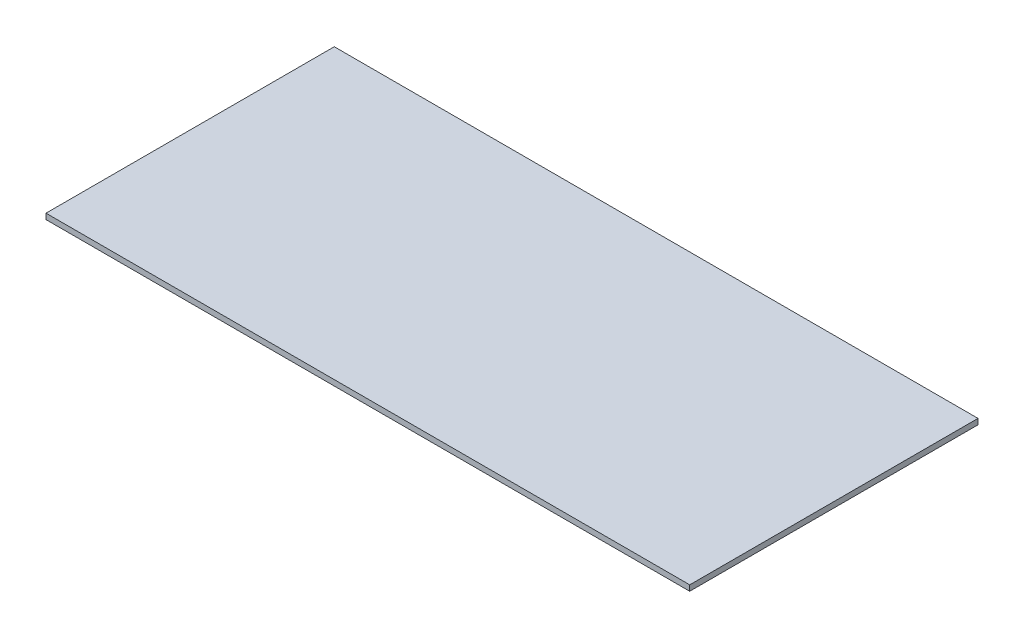
ISO-10303-21;
HEADER;
FILE_DESCRIPTION(('STEP AP214'),'2;1');
FILE_NAME('part.step','',(''),(''),'','','');
FILE_SCHEMA(('AUTOMOTIVE_DESIGN { 1 0 10303 214 1 1 1 1 }'));
ENDSEC;
DATA;
#1=APPLICATION_CONTEXT('core data for automotive mechanical design processes');
#2=APPLICATION_PROTOCOL_DEFINITION('international standard','automotive_design',2000,#1);
#3=PRODUCT_CONTEXT('',#1,'mechanical');
#4=PRODUCT('Part','Part','',(#3));
#5=PRODUCT_RELATED_PRODUCT_CATEGORY('part','',(#4));
#6=PRODUCT_DEFINITION_FORMATION('','',#4);
#7=PRODUCT_DEFINITION_CONTEXT('part definition',#1,'design');
#8=PRODUCT_DEFINITION('design','',#6,#7);
#9=PRODUCT_DEFINITION_SHAPE('','',#8);
#10=(LENGTH_UNIT() NAMED_UNIT(*) SI_UNIT(.MILLI.,.METRE.));
#11=(NAMED_UNIT(*) PLANE_ANGLE_UNIT() SI_UNIT($,.RADIAN.));
#12=(NAMED_UNIT(*) SI_UNIT($,.STERADIAN.) SOLID_ANGLE_UNIT());
#13=UNCERTAINTY_MEASURE_WITH_UNIT(LENGTH_MEASURE(1.E-05),#10,'distance_accuracy_value','');
#14=(GEOMETRIC_REPRESENTATION_CONTEXT(3) GLOBAL_UNCERTAINTY_ASSIGNED_CONTEXT((#13)) GLOBAL_UNIT_ASSIGNED_CONTEXT((#10,
#11,#12)) REPRESENTATION_CONTEXT('',''));
#15=CARTESIAN_POINT('',(0.,0.,0.));
#16=DIRECTION('',(0.,0.,1.));
#17=DIRECTION('',(1.,0.,0.));
#18=AXIS2_PLACEMENT_3D('',#15,#16,#17);
#19=CARTESIAN_POINT('',(-115.,2.,51.5));
#20=DIRECTION('',(1.,0.,0.));
#21=DIRECTION('',(0.,0.,-1.));
#22=AXIS2_PLACEMENT_3D('',#19,#20,#21);
#23=PLANE('',#22);
#24=DIRECTION('',(0.,0.,1.));
#25=VECTOR('',#24,1.);
#26=CARTESIAN_POINT('',(-115.,0.,51.5));
#27=LINE('',#26,#25);
#28=CARTESIAN_POINT('',(-115.,0.,-51.5));
#29=VERTEX_POINT('',#28);
#30=CARTESIAN_POINT('',(-115.,0.,51.5));
#31=VERTEX_POINT('',#30);
#32=EDGE_CURVE('E100',#29,#31,#27,.T.);
#33=ORIENTED_EDGE('',*,*,#32,.T.);
#34=DIRECTION('',(0.,-1.,0.));
#35=VECTOR('',#34,1.);
#36=CARTESIAN_POINT('',(-115.,2.,51.5));
#37=LINE('',#36,#35);
#38=CARTESIAN_POINT('',(-115.,2.,51.5));
#39=VERTEX_POINT('',#38);
#40=EDGE_CURVE('E11',#39,#31,#37,.T.);
#41=ORIENTED_EDGE('',*,*,#40,.F.);
#42=DIRECTION('',(0.,0.,1.));
#43=VECTOR('',#42,1.);
#44=CARTESIAN_POINT('',(-115.,2.,51.5));
#45=LINE('',#44,#43);
#46=CARTESIAN_POINT('',(-115.,2.,-51.5));
#47=VERTEX_POINT('',#46);
#48=EDGE_CURVE('E88',#47,#39,#45,.T.);
#49=ORIENTED_EDGE('',*,*,#48,.F.);
#50=DIRECTION('',(0.,-1.,0.));
#51=VECTOR('',#50,1.);
#52=CARTESIAN_POINT('',(-115.,2.,-51.5));
#53=LINE('',#52,#51);
#54=EDGE_CURVE('E96',#47,#29,#53,.T.);
#55=ORIENTED_EDGE('',*,*,#54,.T.);
#56=EDGE_LOOP('',(#33,#41,#49,#55));
#57=FACE_BOUND('',#56,.T.);
#58=ADVANCED_FACE('F37',(#57),#23,.F.);
#59=CARTESIAN_POINT('',(115.,2.,51.5));
#60=DIRECTION('',(0.,0.,-1.));
#61=DIRECTION('',(-1.,0.,0.));
#62=AXIS2_PLACEMENT_3D('',#59,#60,#61);
#63=PLANE('',#62);
#64=DIRECTION('',(1.,0.,0.));
#65=VECTOR('',#64,1.);
#66=CARTESIAN_POINT('',(115.,0.,51.5));
#67=LINE('',#66,#65);
#68=CARTESIAN_POINT('',(115.,0.,51.5));
#69=VERTEX_POINT('',#68);
#70=EDGE_CURVE('E92',#31,#69,#67,.T.);
#71=ORIENTED_EDGE('',*,*,#70,.T.);
#72=DIRECTION('',(0.,-1.,0.));
#73=VECTOR('',#72,1.);
#74=CARTESIAN_POINT('',(115.,2.,51.5));
#75=LINE('',#74,#73);
#76=CARTESIAN_POINT('',(115.,2.,51.5));
#77=VERTEX_POINT('',#76);
#78=EDGE_CURVE('E45',#77,#69,#75,.T.);
#79=ORIENTED_EDGE('',*,*,#78,.F.);
#80=DIRECTION('',(1.,0.,0.));
#81=VECTOR('',#80,1.);
#82=CARTESIAN_POINT('',(115.,2.,51.5));
#83=LINE('',#82,#81);
#84=EDGE_CURVE('E83',#39,#77,#83,.T.);
#85=ORIENTED_EDGE('',*,*,#84,.F.);
#86=ORIENTED_EDGE('',*,*,#40,.T.);
#87=EDGE_LOOP('',(#71,#79,#85,#86));
#88=FACE_BOUND('',#87,.T.);
#89=ADVANCED_FACE('F91',(#88),#63,.F.);
#90=CARTESIAN_POINT('',(115.,2.,51.5));
#91=DIRECTION('',(-1.,0.,0.));
#92=DIRECTION('',(0.,0.,1.));
#93=AXIS2_PLACEMENT_3D('',#90,#91,#92);
#94=PLANE('',#93);
#95=DIRECTION('',(0.,0.,-1.));
#96=VECTOR('',#95,1.);
#97=CARTESIAN_POINT('',(115.,0.,51.5));
#98=LINE('',#97,#96);
#99=CARTESIAN_POINT('',(115.,0.,-51.5));
#100=VERTEX_POINT('',#99);
#101=EDGE_CURVE('E70',#69,#100,#98,.T.);
#102=ORIENTED_EDGE('',*,*,#101,.T.);
#103=DIRECTION('',(0.,-1.,0.));
#104=VECTOR('',#103,1.);
#105=CARTESIAN_POINT('',(115.,2.,-51.5));
#106=LINE('',#105,#104);
#107=CARTESIAN_POINT('',(115.,2.,-51.5));
#108=VERTEX_POINT('',#107);
#109=EDGE_CURVE('E93',#108,#100,#106,.T.);
#110=ORIENTED_EDGE('',*,*,#109,.F.);
#111=DIRECTION('',(0.,0.,-1.));
#112=VECTOR('',#111,1.);
#113=CARTESIAN_POINT('',(115.,2.,51.5));
#114=LINE('',#113,#112);
#115=EDGE_CURVE('E86',#77,#108,#114,.T.);
#116=ORIENTED_EDGE('',*,*,#115,.F.);
#117=ORIENTED_EDGE('',*,*,#78,.T.);
#118=EDGE_LOOP('',(#102,#110,#116,#117));
#119=FACE_BOUND('',#118,.T.);
#120=ADVANCED_FACE('F94',(#119),#94,.F.);
#121=CARTESIAN_POINT('',(115.,2.,-51.5));
#122=DIRECTION('',(0.,0.,1.));
#123=DIRECTION('',(1.,0.,0.));
#124=AXIS2_PLACEMENT_3D('',#121,#122,#123);
#125=PLANE('',#124);
#126=DIRECTION('',(-1.,0.,0.));
#127=VECTOR('',#126,1.);
#128=CARTESIAN_POINT('',(115.,0.,-51.5));
#129=LINE('',#128,#127);
#130=EDGE_CURVE('E76',#100,#29,#129,.T.);
#131=ORIENTED_EDGE('',*,*,#130,.T.);
#132=ORIENTED_EDGE('',*,*,#54,.F.);
#133=DIRECTION('',(-1.,0.,0.));
#134=VECTOR('',#133,1.);
#135=CARTESIAN_POINT('',(115.,2.,-51.5));
#136=LINE('',#135,#134);
#137=EDGE_CURVE('E53',#108,#47,#136,.T.);
#138=ORIENTED_EDGE('',*,*,#137,.F.);
#139=ORIENTED_EDGE('',*,*,#109,.T.);
#140=EDGE_LOOP('',(#131,#132,#138,#139));
#141=FACE_BOUND('',#140,.T.);
#142=ADVANCED_FACE('F107',(#141),#125,.F.);
#143=CARTESIAN_POINT('',(0.,2.,0.));
#144=DIRECTION('',(0.,1.,0.));
#145=DIRECTION('',(0.,0.,1.));
#146=AXIS2_PLACEMENT_3D('',#143,#144,#145);
#147=PLANE('',#146);
#148=ORIENTED_EDGE('',*,*,#48,.T.);
#149=ORIENTED_EDGE('',*,*,#84,.T.);
#150=ORIENTED_EDGE('',*,*,#115,.T.);
#151=ORIENTED_EDGE('',*,*,#137,.T.);
#152=EDGE_LOOP('',(#148,#149,#150,#151));
#153=FACE_BOUND('',#152,.T.);
#154=ADVANCED_FACE('F84',(#153),#147,.T.);
#155=CARTESIAN_POINT('',(0.,0.,0.));
#156=DIRECTION('',(0.,1.,0.));
#157=DIRECTION('',(0.,0.,1.));
#158=AXIS2_PLACEMENT_3D('',#155,#156,#157);
#159=PLANE('',#158);
#160=ORIENTED_EDGE('',*,*,#32,.F.);
#161=ORIENTED_EDGE('',*,*,#130,.F.);
#162=ORIENTED_EDGE('',*,*,#101,.F.);
#163=ORIENTED_EDGE('',*,*,#70,.F.);
#164=EDGE_LOOP('',(#160,#161,#162,#163));
#165=FACE_BOUND('',#164,.T.);
#166=ADVANCED_FACE('F110',(#165),#159,.F.);
#167=CLOSED_SHELL('',(#58,#89,#120,#142,#154,#166));
#168=MANIFOLD_SOLID_BREP('B2',#167);
#169=ADVANCED_BREP_SHAPE_REPRESENTATION('',(#18,#168),#14);
#170=SHAPE_DEFINITION_REPRESENTATION(#9,#169);
ENDSEC;
END-ISO-10303-21;
